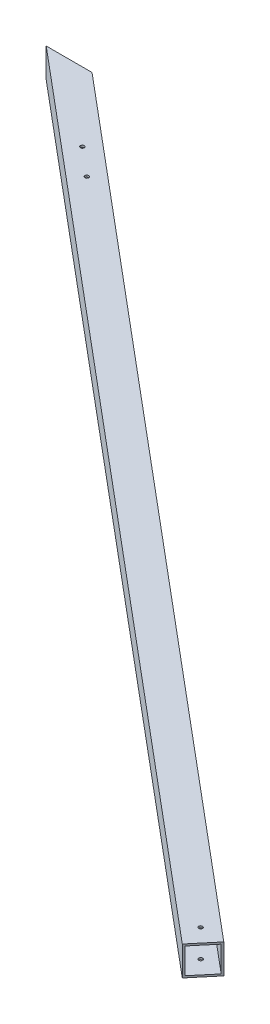
ISO-10303-21;
HEADER;
FILE_DESCRIPTION(('STEP AP214'),'2;1');
FILE_NAME('part.step','',(''),(''),'','','');
FILE_SCHEMA(('AUTOMOTIVE_DESIGN { 1 0 10303 214 1 1 1 1 }'));
ENDSEC;
DATA;
#1=APPLICATION_CONTEXT('core data for automotive mechanical design processes');
#2=APPLICATION_PROTOCOL_DEFINITION('international standard','automotive_design',2000,#1);
#3=PRODUCT_CONTEXT('',#1,'mechanical');
#4=PRODUCT('Part','Part','',(#3));
#5=PRODUCT_RELATED_PRODUCT_CATEGORY('part','',(#4));
#6=PRODUCT_DEFINITION_FORMATION('','',#4);
#7=PRODUCT_DEFINITION_CONTEXT('part definition',#1,'design');
#8=PRODUCT_DEFINITION('design','',#6,#7);
#9=PRODUCT_DEFINITION_SHAPE('','',#8);
#10=(LENGTH_UNIT() NAMED_UNIT(*) SI_UNIT(.MILLI.,.METRE.));
#11=(NAMED_UNIT(*) PLANE_ANGLE_UNIT() SI_UNIT($,.RADIAN.));
#12=(NAMED_UNIT(*) SI_UNIT($,.STERADIAN.) SOLID_ANGLE_UNIT());
#13=UNCERTAINTY_MEASURE_WITH_UNIT(LENGTH_MEASURE(1.E-05),#10,'distance_accuracy_value','');
#14=(GEOMETRIC_REPRESENTATION_CONTEXT(3) GLOBAL_UNCERTAINTY_ASSIGNED_CONTEXT((#13)) GLOBAL_UNIT_ASSIGNED_CONTEXT((#10,
#11,#12)) REPRESENTATION_CONTEXT('',''));
#15=CARTESIAN_POINT('',(0.,0.,0.));
#16=DIRECTION('',(0.,0.,1.));
#17=DIRECTION('',(1.,0.,0.));
#18=AXIS2_PLACEMENT_3D('',#15,#16,#17);
#19=CARTESIAN_POINT('',(1429.46336495137,-165.1,1236.70639682926));
#20=DIRECTION('',(0.766044443118978,0.,0.64278760968654));
#21=DIRECTION('',(0.64278760968654,0.,-0.766044443118978));
#22=AXIS2_PLACEMENT_3D('',#19,#20,#21);
#23=PLANE('',#22);
#24=DIRECTION('',(-0.64278760968654,0.,0.766044443118978));
#25=VECTOR('',#24,1.);
#26=CARTESIAN_POINT('',(1429.46336495137,-215.9,1236.70639682926));
#27=LINE('',#26,#25);
#28=CARTESIAN_POINT('',(1451.03750430922,-215.9,1210.99533874241));
#29=VERTEX_POINT('',#28);
#30=CARTESIAN_POINT('',(1418.38389373714,-215.9,1249.91039645286));
#31=VERTEX_POINT('',#30);
#32=EDGE_CURVE('E158',#29,#31,#27,.T.);
#33=ORIENTED_EDGE('',*,*,#32,.F.);
#34=DIRECTION('',(0.,-1.,0.));
#35=VECTOR('',#34,1.);
#36=CARTESIAN_POINT('',(1451.03750430922,-165.1,1210.99533874241));
#37=LINE('',#36,#35);
#38=CARTESIAN_POINT('',(1451.03750430922,-165.1,1210.99533874241));
#39=VERTEX_POINT('',#38);
#40=EDGE_CURVE('E187',#39,#29,#37,.T.);
#41=ORIENTED_EDGE('',*,*,#40,.F.);
#42=DIRECTION('',(-0.64278760968654,0.,0.766044443118978));
#43=VECTOR('',#42,1.);
#44=CARTESIAN_POINT('',(1429.46336495137,-165.1,1236.70639682926));
#45=LINE('',#44,#43);
#46=CARTESIAN_POINT('',(1418.38389373714,-165.1,1249.91039645286));
#47=VERTEX_POINT('',#46);
#48=EDGE_CURVE('E166',#39,#47,#45,.T.);
#49=ORIENTED_EDGE('',*,*,#48,.T.);
#50=DIRECTION('',(0.,-1.,0.));
#51=VECTOR('',#50,1.);
#52=CARTESIAN_POINT('',(1418.38389373714,-165.1,1249.91039645286));
#53=LINE('',#52,#51);
#54=EDGE_CURVE('E170',#47,#31,#53,.T.);
#55=ORIENTED_EDGE('',*,*,#54,.T.);
#56=EDGE_LOOP('',(#33,#41,#49,#55));
#57=FACE_BOUND('',#56,.T.);
#58=DIRECTION('',(0.,-1.,0.));
#59=VECTOR('',#58,1.);
#60=CARTESIAN_POINT('',(1448.99665364846,-165.1,1213.42752984932));
#61=LINE('',#60,#59);
#62=CARTESIAN_POINT('',(1448.99665364847,-168.275,1213.42752984932));
#63=VERTEX_POINT('',#62);
#64=CARTESIAN_POINT('',(1448.99665364847,-212.725,1213.42752984932));
#65=VERTEX_POINT('',#64);
#66=EDGE_CURVE('E113',#63,#65,#61,.T.);
#67=ORIENTED_EDGE('',*,*,#66,.T.);
#68=DIRECTION('',(-0.64278760968654,0.,0.766044443118978));
#69=VECTOR('',#68,1.);
#70=CARTESIAN_POINT('',(1437.6367948509,-212.725,1226.96568238268));
#71=LINE('',#70,#69);
#72=CARTESIAN_POINT('',(1420.4247443979,-212.725,1247.47820534596));
#73=VERTEX_POINT('',#72);
#74=EDGE_CURVE('E119',#65,#73,#71,.T.);
#75=ORIENTED_EDGE('',*,*,#74,.T.);
#76=DIRECTION('',(0.,-1.,0.));
#77=VECTOR('',#76,1.);
#78=CARTESIAN_POINT('',(1420.4247443979,-165.1,1247.47820534596));
#79=LINE('',#78,#77);
#80=CARTESIAN_POINT('',(1420.4247443979,-168.275,1247.47820534596));
#81=VERTEX_POINT('',#80);
#82=EDGE_CURVE('E104',#81,#73,#79,.T.);
#83=ORIENTED_EDGE('',*,*,#82,.F.);
#84=DIRECTION('',(-0.64278760968654,0.,0.766044443118978));
#85=VECTOR('',#84,1.);
#86=CARTESIAN_POINT('',(1437.6367948509,-168.275,1226.96568238268));
#87=LINE('',#86,#85);
#88=EDGE_CURVE('E114',#63,#81,#87,.T.);
#89=ORIENTED_EDGE('',*,*,#88,.F.);
#90=EDGE_LOOP('',(#67,#75,#83,#89));
#91=FACE_BOUND('',#90,.T.);
#92=ADVANCED_FACE('F16',(#57,#91),#23,.T.);
#93=CARTESIAN_POINT('',(-25.5109240608956,-165.1,25.4));
#94=DIRECTION('',(0.,0.,-1.));
#95=DIRECTION('',(-1.,0.,0.));
#96=AXIS2_PLACEMENT_3D('',#93,#94,#95);
#97=PLANE('',#96);
#98=DIRECTION('',(1.,0.,0.));
#99=VECTOR('',#98,1.);
#100=CARTESIAN_POINT('',(-25.5109240608956,-215.9,25.4));
#101=LINE('',#100,#99);
#102=CARTESIAN_POINT('',(-40.930770404508,-215.9,25.4));
#103=VERTEX_POINT('',#102);
#104=CARTESIAN_POINT('',(38.1,-215.9,25.4));
#105=VERTEX_POINT('',#104);
#106=EDGE_CURVE('E174',#103,#105,#101,.T.);
#107=ORIENTED_EDGE('',*,*,#106,.F.);
#108=DIRECTION('',(0.,-1.,0.));
#109=VECTOR('',#108,1.);
#110=CARTESIAN_POINT('',(-40.930770404508,-165.1,25.4));
#111=LINE('',#110,#109);
#112=CARTESIAN_POINT('',(-40.930770404508,-165.1,25.4));
#113=VERTEX_POINT('',#112);
#114=EDGE_CURVE('E11',#113,#103,#111,.T.);
#115=ORIENTED_EDGE('',*,*,#114,.F.);
#116=DIRECTION('',(1.,0.,0.));
#117=VECTOR('',#116,1.);
#118=CARTESIAN_POINT('',(-25.5109240608956,-165.1,25.4));
#119=LINE('',#118,#117);
#120=CARTESIAN_POINT('',(38.1,-165.1,25.4));
#121=VERTEX_POINT('',#120);
#122=EDGE_CURVE('E157',#113,#121,#119,.T.);
#123=ORIENTED_EDGE('',*,*,#122,.T.);
#124=DIRECTION('',(0.,-1.,0.));
#125=VECTOR('',#124,1.);
#126=CARTESIAN_POINT('',(38.1,-165.1,25.4));
#127=LINE('',#126,#125);
#128=EDGE_CURVE('E26',#121,#105,#127,.T.);
#129=ORIENTED_EDGE('',*,*,#128,.T.);
#130=EDGE_LOOP('',(#107,#115,#123,#129));
#131=FACE_BOUND('',#130,.T.);
#132=DIRECTION('',(0.,-1.,0.));
#133=VECTOR('',#132,1.);
#134=CARTESIAN_POINT('',(-35.9913472542262,-165.1,25.4));
#135=LINE('',#134,#133);
#136=CARTESIAN_POINT('',(-35.9913472542262,-168.275,25.4));
#137=VERTEX_POINT('',#136);
#138=CARTESIAN_POINT('',(-35.9913472542262,-212.725,25.4));
#139=VERTEX_POINT('',#138);
#140=EDGE_CURVE('E143',#137,#139,#135,.T.);
#141=ORIENTED_EDGE('',*,*,#140,.T.);
#142=DIRECTION('',(1.,0.,0.));
#143=VECTOR('',#142,1.);
#144=CARTESIAN_POINT('',(705.053366952357,-212.725,25.4));
#145=LINE('',#144,#143);
#146=CARTESIAN_POINT('',(33.1605768497183,-212.725,25.4));
#147=VERTEX_POINT('',#146);
#148=EDGE_CURVE('E122',#139,#147,#145,.T.);
#149=ORIENTED_EDGE('',*,*,#148,.T.);
#150=DIRECTION('',(0.,-1.,0.));
#151=VECTOR('',#150,1.);
#152=CARTESIAN_POINT('',(33.1605768497183,-165.1,25.4));
#153=LINE('',#152,#151);
#154=CARTESIAN_POINT('',(33.1605768497183,-168.275,25.4));
#155=VERTEX_POINT('',#154);
#156=EDGE_CURVE('E141',#155,#147,#153,.T.);
#157=ORIENTED_EDGE('',*,*,#156,.F.);
#158=DIRECTION('',(1.,0.,0.));
#159=VECTOR('',#158,1.);
#160=CARTESIAN_POINT('',(705.053366952357,-168.275,25.4));
#161=LINE('',#160,#159);
#162=EDGE_CURVE('E134',#137,#155,#161,.T.);
#163=ORIENTED_EDGE('',*,*,#162,.F.);
#164=EDGE_LOOP('',(#141,#149,#157,#163));
#165=FACE_BOUND('',#164,.T.);
#166=ADVANCED_FACE('F241',(#131,#165),#97,.T.);
#167=CARTESIAN_POINT('',(278.112903575089,-165.1,293.109429165724));
#168=DIRECTION('',(-0.64278760968654,0.,0.766044443118978));
#169=DIRECTION('',(0.766044443118978,0.,0.64278760968654));
#170=AXIS2_PLACEMENT_3D('',#167,#168,#169);
#171=PLANE('',#170);
#172=DIRECTION('',(-0.766044443118978,0.,-0.64278760968654));
#173=VECTOR('',#172,1.);
#174=CARTESIAN_POINT('',(278.112903575089,-215.9,293.109429165724));
#175=LINE('',#174,#173);
#176=EDGE_CURVE('E146',#31,#103,#175,.T.);
#177=ORIENTED_EDGE('',*,*,#176,.F.);
#178=ORIENTED_EDGE('',*,*,#54,.F.);
#179=DIRECTION('',(-0.766044443118978,0.,-0.64278760968654));
#180=VECTOR('',#179,1.);
#181=CARTESIAN_POINT('',(278.112903575089,-165.1,293.109429165724));
#182=LINE('',#181,#180);
#183=EDGE_CURVE('E153',#47,#113,#182,.T.);
#184=ORIENTED_EDGE('',*,*,#183,.T.);
#185=ORIENTED_EDGE('',*,*,#114,.T.);
#186=EDGE_LOOP('',(#177,#178,#184,#185));
#187=FACE_BOUND('',#186,.T.);
#188=ADVANCED_FACE('F18',(#187),#171,.T.);
#189=CARTESIAN_POINT('',(360.587988116179,-165.1,295.999551887389));
#190=DIRECTION('',(0.64278760968654,0.,-0.766044443118978));
#191=DIRECTION('',(-0.766044443118978,0.,-0.64278760968654));
#192=AXIS2_PLACEMENT_3D('',#189,#190,#191);
#193=PLANE('',#192);
#194=DIRECTION('',(0.766044443118978,0.,0.64278760968654));
#195=VECTOR('',#194,1.);
#196=CARTESIAN_POINT('',(360.587988116179,-215.9,295.999551887389));
#197=LINE('',#196,#195);
#198=EDGE_CURVE('E178',#105,#29,#197,.T.);
#199=ORIENTED_EDGE('',*,*,#198,.F.);
#200=ORIENTED_EDGE('',*,*,#128,.F.);
#201=DIRECTION('',(0.766044443118978,0.,0.64278760968654));
#202=VECTOR('',#201,1.);
#203=CARTESIAN_POINT('',(360.587988116179,-165.1,295.999551887389));
#204=LINE('',#203,#202);
#205=EDGE_CURVE('E162',#121,#39,#204,.T.);
#206=ORIENTED_EDGE('',*,*,#205,.T.);
#207=ORIENTED_EDGE('',*,*,#40,.T.);
#208=EDGE_LOOP('',(#199,#200,#206,#207));
#209=FACE_BOUND('',#208,.T.);
#210=ADVANCED_FACE('F265',(#209),#193,.T.);
#211=CARTESIAN_POINT('',(705.053366952356,-165.1,612.255198226429));
#212=DIRECTION('',(0.,-1.,0.));
#213=DIRECTION('',(1.,0.,0.));
#214=AXIS2_PLACEMENT_3D('',#211,#212,#213);
#215=PLANE('',#214);
#216=CARTESIAN_POINT('',(140.785030150917,-165.1,144.720316076102));
#217=DIRECTION('',(0.,-1.,0.));
#218=DIRECTION('',(0.,0.,-1.));
#219=AXIS2_PLACEMENT_3D('',#216,#217,#218);
#220=CIRCLE('',#219,3.3782);
#221=CARTESIAN_POINT('',(140.785030150917,-165.1,141.342116076102));
#222=VERTEX_POINT('',#221);
#223=EDGE_CURVE('E212',#222,#222,#220,.F.);
#224=ORIENTED_EDGE('',*,*,#223,.F.);
#225=EDGE_LOOP('',(#224));
#226=FACE_BOUND('',#225,.T.);
#227=CARTESIAN_POINT('',(189.428852288973,-165.1,185.537329291197));
#228=DIRECTION('',(0.,-1.,0.));
#229=DIRECTION('',(0.,0.,-1.));
#230=AXIS2_PLACEMENT_3D('',#227,#228,#229);
#231=CIRCLE('',#230,3.3782);
#232=CARTESIAN_POINT('',(189.428852288973,-165.1,182.159129291197));
#233=VERTEX_POINT('',#232);
#234=EDGE_CURVE('E209',#233,#233,#231,.F.);
#235=ORIENTED_EDGE('',*,*,#234,.F.);
#236=EDGE_LOOP('',(#235));
#237=FACE_BOUND('',#236,.T.);
#238=CARTESIAN_POINT('',(1409.31069902318,-165.1,1209.13973696573));
#239=DIRECTION('',(0.,1.,0.));
#240=DIRECTION('',(0.,0.,1.));
#241=AXIS2_PLACEMENT_3D('',#238,#239,#240);
#242=CIRCLE('',#241,3.36549999999991);
#243=CARTESIAN_POINT('',(1409.31069902318,-165.1,1212.50523696573));
#244=VERTEX_POINT('',#243);
#245=EDGE_CURVE('E196',#244,#244,#242,.T.);
#246=ORIENTED_EDGE('',*,*,#245,.F.);
#247=EDGE_LOOP('',(#246));
#248=FACE_BOUND('',#247,.T.);
#249=ORIENTED_EDGE('',*,*,#183,.F.);
#250=ORIENTED_EDGE('',*,*,#48,.F.);
#251=ORIENTED_EDGE('',*,*,#205,.F.);
#252=ORIENTED_EDGE('',*,*,#122,.F.);
#253=EDGE_LOOP('',(#249,#250,#251,#252));
#254=FACE_BOUND('',#253,.T.);
#255=ADVANCED_FACE('F267',(#226,#237,#248,#254),#215,.F.);
#256=CARTESIAN_POINT('',(705.053366952356,-215.9,612.255198226429));
#257=DIRECTION('',(0.,-1.,0.));
#258=DIRECTION('',(1.,0.,0.));
#259=AXIS2_PLACEMENT_3D('',#256,#257,#258);
#260=PLANE('',#259);
#261=CARTESIAN_POINT('',(140.785030150917,-215.9,144.720316076102));
#262=DIRECTION('',(0.,-1.,0.));
#263=DIRECTION('',(0.,0.,-1.));
#264=AXIS2_PLACEMENT_3D('',#261,#262,#263);
#265=CIRCLE('',#264,3.3782);
#266=CARTESIAN_POINT('',(140.785030150917,-215.9,141.342116076102));
#267=VERTEX_POINT('',#266);
#268=EDGE_CURVE('E291',#267,#267,#265,.T.);
#269=ORIENTED_EDGE('',*,*,#268,.F.);
#270=EDGE_LOOP('',(#269));
#271=FACE_BOUND('',#270,.T.);
#272=CARTESIAN_POINT('',(189.428852288973,-215.9,185.537329291197));
#273=DIRECTION('',(0.,-1.,0.));
#274=DIRECTION('',(0.,0.,-1.));
#275=AXIS2_PLACEMENT_3D('',#272,#273,#274);
#276=CIRCLE('',#275,3.3782);
#277=CARTESIAN_POINT('',(189.428852288973,-215.9,182.159129291197));
#278=VERTEX_POINT('',#277);
#279=EDGE_CURVE('E201',#278,#278,#276,.T.);
#280=ORIENTED_EDGE('',*,*,#279,.F.);
#281=EDGE_LOOP('',(#280));
#282=FACE_BOUND('',#281,.T.);
#283=CARTESIAN_POINT('',(1409.31069902318,-215.9,1209.13973696573));
#284=DIRECTION('',(0.,-1.,0.));
#285=DIRECTION('',(0.,0.,-1.));
#286=AXIS2_PLACEMENT_3D('',#283,#284,#285);
#287=CIRCLE('',#286,3.36549999999991);
#288=CARTESIAN_POINT('',(1409.31069902318,-215.9,1205.77423696573));
#289=VERTEX_POINT('',#288);
#290=EDGE_CURVE('E124',#289,#289,#287,.F.);
#291=ORIENTED_EDGE('',*,*,#290,.T.);
#292=EDGE_LOOP('',(#291));
#293=FACE_BOUND('',#292,.T.);
#294=ORIENTED_EDGE('',*,*,#176,.T.);
#295=ORIENTED_EDGE('',*,*,#106,.T.);
#296=ORIENTED_EDGE('',*,*,#198,.T.);
#297=ORIENTED_EDGE('',*,*,#32,.T.);
#298=EDGE_LOOP('',(#294,#295,#296,#297));
#299=FACE_BOUND('',#298,.T.);
#300=ADVANCED_FACE('F252',(#271,#282,#293,#299),#260,.T.);
#301=CARTESIAN_POINT('',(280.153754235844,-165.1,290.677238058822));
#302=DIRECTION('',(-0.64278760968654,0.,0.766044443118978));
#303=DIRECTION('',(0.766044443118978,0.,0.64278760968654));
#304=AXIS2_PLACEMENT_3D('',#301,#302,#303);
#305=PLANE('',#304);
#306=DIRECTION('',(-0.766044443118978,0.,-0.64278760968654));
#307=VECTOR('',#306,1.);
#308=CARTESIAN_POINT('',(687.841316499359,-212.725,632.767721189702));
#309=LINE('',#308,#307);
#310=EDGE_CURVE('E107',#73,#139,#309,.T.);
#311=ORIENTED_EDGE('',*,*,#310,.T.);
#312=ORIENTED_EDGE('',*,*,#140,.F.);
#313=DIRECTION('',(-0.766044443118978,0.,-0.64278760968654));
#314=VECTOR('',#313,1.);
#315=CARTESIAN_POINT('',(687.841316499359,-168.275,632.767721189702));
#316=LINE('',#315,#314);
#317=EDGE_CURVE('E39',#81,#137,#316,.T.);
#318=ORIENTED_EDGE('',*,*,#317,.F.);
#319=ORIENTED_EDGE('',*,*,#82,.T.);
#320=EDGE_LOOP('',(#311,#312,#318,#319));
#321=FACE_BOUND('',#320,.T.);
#322=ADVANCED_FACE('F106',(#321),#305,.F.);
#323=CARTESIAN_POINT('',(358.547137455424,-165.1,298.431742994291));
#324=DIRECTION('',(0.64278760968654,0.,-0.766044443118978));
#325=DIRECTION('',(-0.766044443118978,0.,-0.64278760968654));
#326=AXIS2_PLACEMENT_3D('',#323,#324,#325);
#327=PLANE('',#326);
#328=DIRECTION('',(0.766044443118978,0.,0.64278760968654));
#329=VECTOR('',#328,1.);
#330=CARTESIAN_POINT('',(716.413225749925,-212.725,598.717045693064));
#331=LINE('',#330,#329);
#332=EDGE_CURVE('E128',#147,#65,#331,.T.);
#333=ORIENTED_EDGE('',*,*,#332,.T.);
#334=ORIENTED_EDGE('',*,*,#66,.F.);
#335=DIRECTION('',(0.766044443118978,0.,0.64278760968654));
#336=VECTOR('',#335,1.);
#337=CARTESIAN_POINT('',(716.413225749925,-168.275,598.717045693064));
#338=LINE('',#337,#336);
#339=EDGE_CURVE('E52',#155,#63,#338,.T.);
#340=ORIENTED_EDGE('',*,*,#339,.F.);
#341=ORIENTED_EDGE('',*,*,#156,.T.);
#342=EDGE_LOOP('',(#333,#334,#340,#341));
#343=FACE_BOUND('',#342,.T.);
#344=ADVANCED_FACE('F242',(#343),#327,.F.);
#345=CARTESIAN_POINT('',(705.053366952356,-168.275,612.255198226429));
#346=DIRECTION('',(0.,-1.,0.));
#347=DIRECTION('',(1.,0.,0.));
#348=AXIS2_PLACEMENT_3D('',#345,#346,#347);
#349=PLANE('',#348);
#350=CARTESIAN_POINT('',(140.785030150917,-168.275,144.720316076102));
#351=DIRECTION('',(0.,-1.,0.));
#352=DIRECTION('',(0.,0.,-1.));
#353=AXIS2_PLACEMENT_3D('',#350,#351,#352);
#354=CIRCLE('',#353,3.3782);
#355=CARTESIAN_POINT('',(140.785030150917,-168.275,141.342116076102));
#356=VERTEX_POINT('',#355);
#357=EDGE_CURVE('E219',#356,#356,#354,.F.);
#358=ORIENTED_EDGE('',*,*,#357,.T.);
#359=EDGE_LOOP('',(#358));
#360=FACE_BOUND('',#359,.T.);
#361=CARTESIAN_POINT('',(189.428852288973,-168.275,185.537329291197));
#362=DIRECTION('',(0.,-1.,0.));
#363=DIRECTION('',(0.,0.,-1.));
#364=AXIS2_PLACEMENT_3D('',#361,#362,#363);
#365=CIRCLE('',#364,3.3782);
#366=CARTESIAN_POINT('',(189.428852288973,-168.275,182.159129291197));
#367=VERTEX_POINT('',#366);
#368=EDGE_CURVE('E200',#367,#367,#365,.F.);
#369=ORIENTED_EDGE('',*,*,#368,.T.);
#370=EDGE_LOOP('',(#369));
#371=FACE_BOUND('',#370,.T.);
#372=CARTESIAN_POINT('',(1409.31069902318,-168.275,1209.13973696573));
#373=DIRECTION('',(0.,-1.,0.));
#374=DIRECTION('',(0.,0.,-1.));
#375=AXIS2_PLACEMENT_3D('',#372,#373,#374);
#376=CIRCLE('',#375,3.36549999999991);
#377=CARTESIAN_POINT('',(1409.31069902318,-168.275,1205.77423696573));
#378=VERTEX_POINT('',#377);
#379=EDGE_CURVE('E195',#378,#378,#376,.F.);
#380=ORIENTED_EDGE('',*,*,#379,.T.);
#381=EDGE_LOOP('',(#380));
#382=FACE_BOUND('',#381,.T.);
#383=ORIENTED_EDGE('',*,*,#317,.T.);
#384=ORIENTED_EDGE('',*,*,#162,.T.);
#385=ORIENTED_EDGE('',*,*,#339,.T.);
#386=ORIENTED_EDGE('',*,*,#88,.T.);
#387=EDGE_LOOP('',(#383,#384,#385,#386));
#388=FACE_BOUND('',#387,.T.);
#389=ADVANCED_FACE('F237',(#360,#371,#382,#388),#349,.T.);
#390=CARTESIAN_POINT('',(705.053366952356,-212.725,612.255198226429));
#391=DIRECTION('',(0.,-1.,0.));
#392=DIRECTION('',(1.,0.,0.));
#393=AXIS2_PLACEMENT_3D('',#390,#391,#392);
#394=PLANE('',#393);
#395=CARTESIAN_POINT('',(140.785030150917,-212.725,144.720316076102));
#396=DIRECTION('',(0.,-1.,0.));
#397=DIRECTION('',(0.,0.,-1.));
#398=AXIS2_PLACEMENT_3D('',#395,#396,#397);
#399=CIRCLE('',#398,3.3782);
#400=CARTESIAN_POINT('',(140.785030150917,-212.725,141.342116076102));
#401=VERTEX_POINT('',#400);
#402=EDGE_CURVE('E20',#401,#401,#399,.F.);
#403=ORIENTED_EDGE('',*,*,#402,.F.);
#404=EDGE_LOOP('',(#403));
#405=FACE_BOUND('',#404,.T.);
#406=CARTESIAN_POINT('',(189.428852288973,-212.725,185.537329291197));
#407=DIRECTION('',(0.,-1.,0.));
#408=DIRECTION('',(0.,0.,-1.));
#409=AXIS2_PLACEMENT_3D('',#406,#407,#408);
#410=CIRCLE('',#409,3.3782);
#411=CARTESIAN_POINT('',(189.428852288973,-212.725,182.159129291197));
#412=VERTEX_POINT('',#411);
#413=EDGE_CURVE('E197',#412,#412,#410,.F.);
#414=ORIENTED_EDGE('',*,*,#413,.F.);
#415=EDGE_LOOP('',(#414));
#416=FACE_BOUND('',#415,.T.);
#417=CARTESIAN_POINT('',(1409.31069902318,-212.725,1209.13973696573));
#418=DIRECTION('',(0.,-1.,0.));
#419=DIRECTION('',(0.,0.,-1.));
#420=AXIS2_PLACEMENT_3D('',#417,#418,#419);
#421=CIRCLE('',#420,3.36549999999991);
#422=CARTESIAN_POINT('',(1409.31069902318,-212.725,1205.77423696573));
#423=VERTEX_POINT('',#422);
#424=EDGE_CURVE('E192',#423,#423,#421,.F.);
#425=ORIENTED_EDGE('',*,*,#424,.F.);
#426=EDGE_LOOP('',(#425));
#427=FACE_BOUND('',#426,.T.);
#428=ORIENTED_EDGE('',*,*,#310,.F.);
#429=ORIENTED_EDGE('',*,*,#74,.F.);
#430=ORIENTED_EDGE('',*,*,#332,.F.);
#431=ORIENTED_EDGE('',*,*,#148,.F.);
#432=EDGE_LOOP('',(#428,#429,#430,#431));
#433=FACE_BOUND('',#432,.T.);
#434=ADVANCED_FACE('F117',(#405,#416,#427,#433),#394,.F.);
#435=CARTESIAN_POINT('',(1409.31069902318,-2096.9077430591,1209.13973696573));
#436=DIRECTION('',(0.,1.,0.));
#437=DIRECTION('',(0.,0.,1.));
#438=AXIS2_PLACEMENT_3D('',#435,#436,#437);
#439=CYLINDRICAL_SURFACE('',#438,3.36549999999991);
#440=ORIENTED_EDGE('',*,*,#290,.F.);
#441=EDGE_LOOP('',(#440));
#442=FACE_BOUND('',#441,.T.);
#443=ORIENTED_EDGE('',*,*,#424,.T.);
#444=EDGE_LOOP('',(#443));
#445=FACE_BOUND('',#444,.T.);
#446=ADVANCED_FACE('F295',(#442,#445),#439,.F.);
#447=ORIENTED_EDGE('',*,*,#379,.F.);
#448=EDGE_LOOP('',(#447));
#449=FACE_BOUND('',#448,.T.);
#450=ORIENTED_EDGE('',*,*,#245,.T.);
#451=EDGE_LOOP('',(#450));
#452=FACE_BOUND('',#451,.T.);
#453=ADVANCED_FACE('F298',(#449,#452),#439,.F.);
#454=CARTESIAN_POINT('',(189.428852288973,1715.91155852403,185.537329291197));
#455=DIRECTION('',(0.,-1.,0.));
#456=DIRECTION('',(0.,0.,-1.));
#457=AXIS2_PLACEMENT_3D('',#454,#455,#456);
#458=CYLINDRICAL_SURFACE('',#457,3.3782);
#459=ORIENTED_EDGE('',*,*,#279,.T.);
#460=EDGE_LOOP('',(#459));
#461=FACE_BOUND('',#460,.T.);
#462=ORIENTED_EDGE('',*,*,#413,.T.);
#463=EDGE_LOOP('',(#462));
#464=FACE_BOUND('',#463,.T.);
#465=ADVANCED_FACE('F329',(#461,#464),#458,.F.);
#466=ORIENTED_EDGE('',*,*,#368,.F.);
#467=EDGE_LOOP('',(#466));
#468=FACE_BOUND('',#467,.T.);
#469=ORIENTED_EDGE('',*,*,#234,.T.);
#470=EDGE_LOOP('',(#469));
#471=FACE_BOUND('',#470,.T.);
#472=ADVANCED_FACE('F322',(#468,#471),#458,.F.);
#473=CARTESIAN_POINT('',(140.785030150917,1715.91155852403,144.720316076102));
#474=DIRECTION('',(0.,-1.,0.));
#475=DIRECTION('',(0.,0.,-1.));
#476=AXIS2_PLACEMENT_3D('',#473,#474,#475);
#477=CYLINDRICAL_SURFACE('',#476,3.3782);
#478=ORIENTED_EDGE('',*,*,#268,.T.);
#479=EDGE_LOOP('',(#478));
#480=FACE_BOUND('',#479,.T.);
#481=ORIENTED_EDGE('',*,*,#402,.T.);
#482=EDGE_LOOP('',(#481));
#483=FACE_BOUND('',#482,.T.);
#484=ADVANCED_FACE('F319',(#480,#483),#477,.F.);
#485=ORIENTED_EDGE('',*,*,#357,.F.);
#486=EDGE_LOOP('',(#485));
#487=FACE_BOUND('',#486,.T.);
#488=ORIENTED_EDGE('',*,*,#223,.T.);
#489=EDGE_LOOP('',(#488));
#490=FACE_BOUND('',#489,.T.);
#491=ADVANCED_FACE('F321',(#487,#490),#477,.F.);
#492=CLOSED_SHELL('',(#92,#166,#188,#210,#255,#300,#322,#344,#389,#434,#446,#453,#465,#472,#484,#491));
#493=MANIFOLD_SOLID_BREP('B1',#492);
#494=ADVANCED_BREP_SHAPE_REPRESENTATION('',(#18,#493),#14);
#495=SHAPE_DEFINITION_REPRESENTATION(#9,#494);
ENDSEC;
END-ISO-10303-21;
